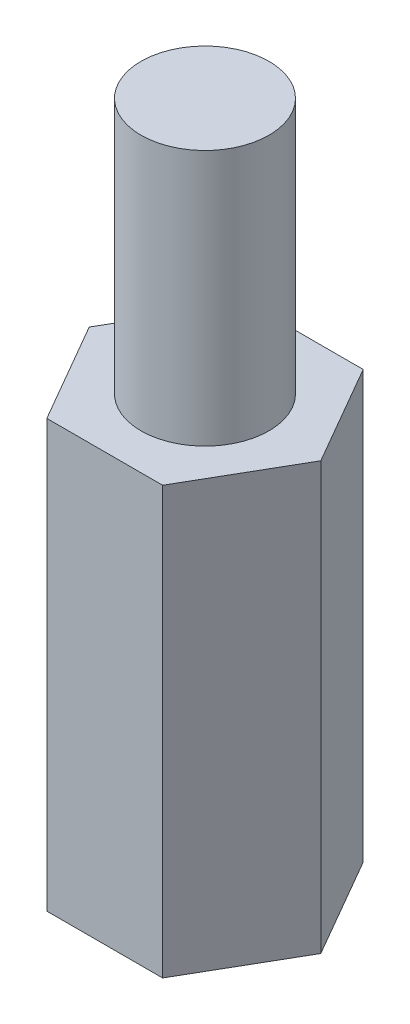
ISO-10303-21;
HEADER;
FILE_DESCRIPTION(('STEP AP214'),'2;1');
FILE_NAME('part.step','',(''),(''),'','','');
FILE_SCHEMA(('AUTOMOTIVE_DESIGN { 1 0 10303 214 1 1 1 1 }'));
ENDSEC;
DATA;
#1=APPLICATION_CONTEXT('core data for automotive mechanical design processes');
#2=APPLICATION_PROTOCOL_DEFINITION('international standard','automotive_design',2000,#1);
#3=PRODUCT_CONTEXT('',#1,'mechanical');
#4=PRODUCT('Part','Part','',(#3));
#5=PRODUCT_RELATED_PRODUCT_CATEGORY('part','',(#4));
#6=PRODUCT_DEFINITION_FORMATION('','',#4);
#7=PRODUCT_DEFINITION_CONTEXT('part definition',#1,'design');
#8=PRODUCT_DEFINITION('design','',#6,#7);
#9=PRODUCT_DEFINITION_SHAPE('','',#8);
#10=(LENGTH_UNIT() NAMED_UNIT(*) SI_UNIT(.MILLI.,.METRE.));
#11=(NAMED_UNIT(*) PLANE_ANGLE_UNIT() SI_UNIT($,.RADIAN.));
#12=(NAMED_UNIT(*) SI_UNIT($,.STERADIAN.) SOLID_ANGLE_UNIT());
#13=UNCERTAINTY_MEASURE_WITH_UNIT(LENGTH_MEASURE(1.E-05),#10,'distance_accuracy_value','');
#14=(GEOMETRIC_REPRESENTATION_CONTEXT(3) GLOBAL_UNCERTAINTY_ASSIGNED_CONTEXT((#13)) GLOBAL_UNIT_ASSIGNED_CONTEXT((#10,
#11,#12)) REPRESENTATION_CONTEXT('',''));
#15=CARTESIAN_POINT('',(0.,0.,0.));
#16=DIRECTION('',(0.,0.,1.));
#17=DIRECTION('',(1.,0.,0.));
#18=AXIS2_PLACEMENT_3D('',#15,#16,#17);
#19=CARTESIAN_POINT('',(2.71354626519124,10.,0.));
#20=DIRECTION('',(-0.866025403784438,0.,0.5));
#21=DIRECTION('',(0.5,0.,0.866025403784439));
#22=AXIS2_PLACEMENT_3D('',#19,#20,#21);
#23=PLANE('',#22);
#24=DIRECTION('',(-0.5,0.,-0.866025403784438));
#25=VECTOR('',#24,1.);
#26=CARTESIAN_POINT('',(2.71354626519124,0.,0.));
#27=LINE('',#26,#25);
#28=CARTESIAN_POINT('',(2.71354626519124,0.,0.));
#29=VERTEX_POINT('',#28);
#30=CARTESIAN_POINT('',(1.35677313259562,0.,-2.35));
#31=VERTEX_POINT('',#30);
#32=EDGE_CURVE('E120',#29,#31,#27,.T.);
#33=ORIENTED_EDGE('',*,*,#32,.T.);
#34=DIRECTION('',(0.,-1.,0.));
#35=VECTOR('',#34,1.);
#36=CARTESIAN_POINT('',(1.35677313259562,10.,-2.35));
#37=LINE('',#36,#35);
#38=CARTESIAN_POINT('',(1.35677313259562,10.,-2.35));
#39=VERTEX_POINT('',#38);
#40=EDGE_CURVE('E37',#39,#31,#37,.T.);
#41=ORIENTED_EDGE('',*,*,#40,.F.);
#42=DIRECTION('',(-0.5,0.,-0.866025403784438));
#43=VECTOR('',#42,1.);
#44=CARTESIAN_POINT('',(2.71354626519124,10.,0.));
#45=LINE('',#44,#43);
#46=CARTESIAN_POINT('',(2.71354626519124,10.,0.));
#47=VERTEX_POINT('',#46);
#48=EDGE_CURVE('E131',#47,#39,#45,.T.);
#49=ORIENTED_EDGE('',*,*,#48,.F.);
#50=DIRECTION('',(0.,-1.,0.));
#51=VECTOR('',#50,1.);
#52=CARTESIAN_POINT('',(2.71354626519124,10.,0.));
#53=LINE('',#52,#51);
#54=EDGE_CURVE('E116',#47,#29,#53,.T.);
#55=ORIENTED_EDGE('',*,*,#54,.T.);
#56=EDGE_LOOP('',(#33,#41,#49,#55));
#57=FACE_BOUND('',#56,.T.);
#58=ADVANCED_FACE('F34',(#57),#23,.F.);
#59=CARTESIAN_POINT('',(1.35677313259562,10.,-2.35));
#60=DIRECTION('',(0.,0.,1.));
#61=DIRECTION('',(1.,0.,0.));
#62=AXIS2_PLACEMENT_3D('',#59,#60,#61);
#63=PLANE('',#62);
#64=DIRECTION('',(-1.,0.,0.));
#65=VECTOR('',#64,1.);
#66=CARTESIAN_POINT('',(1.35677313259562,0.,-2.35));
#67=LINE('',#66,#65);
#68=CARTESIAN_POINT('',(-1.35677313259562,0.,-2.35));
#69=VERTEX_POINT('',#68);
#70=EDGE_CURVE('E123',#31,#69,#67,.T.);
#71=ORIENTED_EDGE('',*,*,#70,.T.);
#72=DIRECTION('',(0.,-1.,0.));
#73=VECTOR('',#72,1.);
#74=CARTESIAN_POINT('',(-1.35677313259562,10.,-2.35));
#75=LINE('',#74,#73);
#76=CARTESIAN_POINT('',(-1.35677313259562,10.,-2.35));
#77=VERTEX_POINT('',#76);
#78=EDGE_CURVE('E134',#77,#69,#75,.T.);
#79=ORIENTED_EDGE('',*,*,#78,.F.);
#80=DIRECTION('',(-1.,0.,0.));
#81=VECTOR('',#80,1.);
#82=CARTESIAN_POINT('',(1.35677313259562,10.,-2.35));
#83=LINE('',#82,#81);
#84=EDGE_CURVE('E89',#39,#77,#83,.T.);
#85=ORIENTED_EDGE('',*,*,#84,.F.);
#86=ORIENTED_EDGE('',*,*,#40,.T.);
#87=EDGE_LOOP('',(#71,#79,#85,#86));
#88=FACE_BOUND('',#87,.T.);
#89=ADVANCED_FACE('F139',(#88),#63,.F.);
#90=CARTESIAN_POINT('',(-1.35677313259562,10.,-2.35));
#91=DIRECTION('',(0.866025403784439,0.,0.5));
#92=DIRECTION('',(0.5,0.,-0.866025403784439));
#93=AXIS2_PLACEMENT_3D('',#90,#91,#92);
#94=PLANE('',#93);
#95=DIRECTION('',(-0.5,0.,0.866025403784439));
#96=VECTOR('',#95,1.);
#97=CARTESIAN_POINT('',(-1.35677313259562,0.,-2.35));
#98=LINE('',#97,#96);
#99=CARTESIAN_POINT('',(-2.71354626519124,0.,0.));
#100=VERTEX_POINT('',#99);
#101=EDGE_CURVE('E126',#69,#100,#98,.T.);
#102=ORIENTED_EDGE('',*,*,#101,.T.);
#103=DIRECTION('',(0.,-1.,0.));
#104=VECTOR('',#103,1.);
#105=CARTESIAN_POINT('',(-2.71354626519124,10.,0.));
#106=LINE('',#105,#104);
#107=CARTESIAN_POINT('',(-2.71354626519124,10.,0.));
#108=VERTEX_POINT('',#107);
#109=EDGE_CURVE('E111',#108,#100,#106,.T.);
#110=ORIENTED_EDGE('',*,*,#109,.F.);
#111=DIRECTION('',(-0.5,0.,0.866025403784439));
#112=VECTOR('',#111,1.);
#113=CARTESIAN_POINT('',(-1.35677313259562,10.,-2.35));
#114=LINE('',#113,#112);
#115=EDGE_CURVE('E102',#77,#108,#114,.T.);
#116=ORIENTED_EDGE('',*,*,#115,.F.);
#117=ORIENTED_EDGE('',*,*,#78,.T.);
#118=EDGE_LOOP('',(#102,#110,#116,#117));
#119=FACE_BOUND('',#118,.T.);
#120=ADVANCED_FACE('F145',(#119),#94,.F.);
#121=CARTESIAN_POINT('',(-2.71354626519124,10.,0.));
#122=DIRECTION('',(0.866025403784438,0.,-0.5));
#123=DIRECTION('',(-0.5,0.,-0.866025403784438));
#124=AXIS2_PLACEMENT_3D('',#121,#122,#123);
#125=PLANE('',#124);
#126=DIRECTION('',(0.5,0.,0.866025403784438));
#127=VECTOR('',#126,1.);
#128=CARTESIAN_POINT('',(-2.71354626519124,0.,0.));
#129=LINE('',#128,#127);
#130=CARTESIAN_POINT('',(-1.35677313259562,0.,2.35));
#131=VERTEX_POINT('',#130);
#132=EDGE_CURVE('E110',#100,#131,#129,.T.);
#133=ORIENTED_EDGE('',*,*,#132,.T.);
#134=DIRECTION('',(0.,-1.,0.));
#135=VECTOR('',#134,1.);
#136=CARTESIAN_POINT('',(-1.35677313259562,10.,2.35));
#137=LINE('',#136,#135);
#138=CARTESIAN_POINT('',(-1.35677313259562,10.,2.35));
#139=VERTEX_POINT('',#138);
#140=EDGE_CURVE('E107',#139,#131,#137,.T.);
#141=ORIENTED_EDGE('',*,*,#140,.F.);
#142=DIRECTION('',(0.5,0.,0.866025403784438));
#143=VECTOR('',#142,1.);
#144=CARTESIAN_POINT('',(-2.71354626519124,10.,0.));
#145=LINE('',#144,#143);
#146=EDGE_CURVE('E96',#108,#139,#145,.T.);
#147=ORIENTED_EDGE('',*,*,#146,.F.);
#148=ORIENTED_EDGE('',*,*,#109,.T.);
#149=EDGE_LOOP('',(#133,#141,#147,#148));
#150=FACE_BOUND('',#149,.T.);
#151=ADVANCED_FACE('F108',(#150),#125,.F.);
#152=CARTESIAN_POINT('',(-1.35677313259562,10.,2.35));
#153=DIRECTION('',(0.,0.,-1.));
#154=DIRECTION('',(-1.,0.,0.));
#155=AXIS2_PLACEMENT_3D('',#152,#153,#154);
#156=PLANE('',#155);
#157=DIRECTION('',(1.,0.,0.));
#158=VECTOR('',#157,1.);
#159=CARTESIAN_POINT('',(-1.35677313259562,0.,2.35));
#160=LINE('',#159,#158);
#161=CARTESIAN_POINT('',(1.35677313259562,0.,2.35));
#162=VERTEX_POINT('',#161);
#163=EDGE_CURVE('E74',#131,#162,#160,.T.);
#164=ORIENTED_EDGE('',*,*,#163,.T.);
#165=DIRECTION('',(0.,-1.,0.));
#166=VECTOR('',#165,1.);
#167=CARTESIAN_POINT('',(1.35677313259562,10.,2.35));
#168=LINE('',#167,#166);
#169=CARTESIAN_POINT('',(1.35677313259562,10.,2.35));
#170=VERTEX_POINT('',#169);
#171=EDGE_CURVE('E112',#170,#162,#168,.T.);
#172=ORIENTED_EDGE('',*,*,#171,.F.);
#173=DIRECTION('',(1.,0.,0.));
#174=VECTOR('',#173,1.);
#175=CARTESIAN_POINT('',(-1.35677313259562,10.,2.35));
#176=LINE('',#175,#174);
#177=EDGE_CURVE('E100',#139,#170,#176,.T.);
#178=ORIENTED_EDGE('',*,*,#177,.F.);
#179=ORIENTED_EDGE('',*,*,#140,.T.);
#180=EDGE_LOOP('',(#164,#172,#178,#179));
#181=FACE_BOUND('',#180,.T.);
#182=ADVANCED_FACE('F114',(#181),#156,.F.);
#183=CARTESIAN_POINT('',(1.35677313259562,10.,2.35));
#184=DIRECTION('',(-0.866025403784439,0.,-0.5));
#185=DIRECTION('',(-0.5,0.,0.866025403784439));
#186=AXIS2_PLACEMENT_3D('',#183,#184,#185);
#187=PLANE('',#186);
#188=DIRECTION('',(0.5,0.,-0.866025403784439));
#189=VECTOR('',#188,1.);
#190=CARTESIAN_POINT('',(1.35677313259562,0.,2.35));
#191=LINE('',#190,#189);
#192=EDGE_CURVE('E80',#162,#29,#191,.T.);
#193=ORIENTED_EDGE('',*,*,#192,.T.);
#194=ORIENTED_EDGE('',*,*,#54,.F.);
#195=DIRECTION('',(0.5,0.,-0.866025403784439));
#196=VECTOR('',#195,1.);
#197=CARTESIAN_POINT('',(1.35677313259562,10.,2.35));
#198=LINE('',#197,#196);
#199=EDGE_CURVE('E51',#170,#47,#198,.T.);
#200=ORIENTED_EDGE('',*,*,#199,.F.);
#201=ORIENTED_EDGE('',*,*,#171,.T.);
#202=EDGE_LOOP('',(#193,#194,#200,#201));
#203=FACE_BOUND('',#202,.T.);
#204=ADVANCED_FACE('F176',(#203),#187,.F.);
#205=CARTESIAN_POINT('',(0.,10.,0.));
#206=DIRECTION('',(0.,1.,0.));
#207=DIRECTION('',(0.,0.,1.));
#208=AXIS2_PLACEMENT_3D('',#205,#206,#207);
#209=PLANE('',#208);
#210=CARTESIAN_POINT('',(0.,10.,0.));
#211=DIRECTION('',(0.,1.,0.));
#212=DIRECTION('',(0.,0.,1.));
#213=AXIS2_PLACEMENT_3D('',#210,#211,#212);
#214=CIRCLE('',#213,1.5);
#215=CARTESIAN_POINT('',(0.,10.,1.5));
#216=VERTEX_POINT('',#215);
#217=EDGE_CURVE('E11',#216,#216,#214,.T.);
#218=ORIENTED_EDGE('',*,*,#217,.F.);
#219=EDGE_LOOP('',(#218));
#220=FACE_BOUND('',#219,.T.);
#221=ORIENTED_EDGE('',*,*,#48,.T.);
#222=ORIENTED_EDGE('',*,*,#84,.T.);
#223=ORIENTED_EDGE('',*,*,#115,.T.);
#224=ORIENTED_EDGE('',*,*,#146,.T.);
#225=ORIENTED_EDGE('',*,*,#177,.T.);
#226=ORIENTED_EDGE('',*,*,#199,.T.);
#227=EDGE_LOOP('',(#221,#222,#223,#224,#225,#226));
#228=FACE_BOUND('',#227,.T.);
#229=ADVANCED_FACE('F98',(#220,#228),#209,.T.);
#230=CARTESIAN_POINT('',(0.,0.,0.));
#231=DIRECTION('',(0.,1.,0.));
#232=DIRECTION('',(0.,0.,1.));
#233=AXIS2_PLACEMENT_3D('',#230,#231,#232);
#234=PLANE('',#233);
#235=CARTESIAN_POINT('',(0.,0.,0.));
#236=DIRECTION('',(0.,-1.,0.));
#237=DIRECTION('',(0.,0.,-1.));
#238=AXIS2_PLACEMENT_3D('',#235,#236,#237);
#239=CIRCLE('',#238,1.5);
#240=CARTESIAN_POINT('',(0.,0.,-1.5));
#241=VERTEX_POINT('',#240);
#242=EDGE_CURVE('E152',#241,#241,#239,.T.);
#243=ORIENTED_EDGE('',*,*,#242,.F.);
#244=EDGE_LOOP('',(#243));
#245=FACE_BOUND('',#244,.T.);
#246=ORIENTED_EDGE('',*,*,#32,.F.);
#247=ORIENTED_EDGE('',*,*,#192,.F.);
#248=ORIENTED_EDGE('',*,*,#163,.F.);
#249=ORIENTED_EDGE('',*,*,#132,.F.);
#250=ORIENTED_EDGE('',*,*,#101,.F.);
#251=ORIENTED_EDGE('',*,*,#70,.F.);
#252=EDGE_LOOP('',(#246,#247,#248,#249,#250,#251));
#253=FACE_BOUND('',#252,.T.);
#254=ADVANCED_FACE('F144',(#245,#253),#234,.F.);
#255=CARTESIAN_POINT('',(0.,16.,0.));
#256=DIRECTION('',(0.,-1.,0.));
#257=DIRECTION('',(0.,0.,-1.));
#258=AXIS2_PLACEMENT_3D('',#255,#256,#257);
#259=CYLINDRICAL_SURFACE('',#258,1.5);
#260=CARTESIAN_POINT('',(0.,16.,0.));
#261=DIRECTION('',(0.,1.,0.));
#262=DIRECTION('',(0.,0.,1.));
#263=AXIS2_PLACEMENT_3D('',#260,#261,#262);
#264=CIRCLE('',#263,1.5);
#265=CARTESIAN_POINT('',(0.,16.,1.5));
#266=VERTEX_POINT('',#265);
#267=EDGE_CURVE('E124',#266,#266,#264,.T.);
#268=ORIENTED_EDGE('',*,*,#267,.F.);
#269=EDGE_LOOP('',(#268));
#270=FACE_BOUND('',#269,.T.);
#271=ORIENTED_EDGE('',*,*,#217,.T.);
#272=EDGE_LOOP('',(#271));
#273=FACE_BOUND('',#272,.T.);
#274=ADVANCED_FACE('F168',(#270,#273),#259,.T.);
#275=CARTESIAN_POINT('',(0.,16.,0.));
#276=DIRECTION('',(0.,1.,0.));
#277=DIRECTION('',(0.,0.,1.));
#278=AXIS2_PLACEMENT_3D('',#275,#276,#277);
#279=PLANE('',#278);
#280=ORIENTED_EDGE('',*,*,#267,.T.);
#281=EDGE_LOOP('',(#280));
#282=FACE_BOUND('',#281,.T.);
#283=ADVANCED_FACE('F163',(#282),#279,.T.);
#284=CARTESIAN_POINT('',(0.,7.,0.));
#285=DIRECTION('',(0.,-1.,0.));
#286=DIRECTION('',(0.,0.,-1.));
#287=AXIS2_PLACEMENT_3D('',#284,#285,#286);
#288=CYLINDRICAL_SURFACE('',#287,1.5);
#289=CARTESIAN_POINT('',(0.,7.,0.));
#290=DIRECTION('',(0.,-1.,0.));
#291=DIRECTION('',(0.,0.,-1.));
#292=AXIS2_PLACEMENT_3D('',#289,#290,#291);
#293=CIRCLE('',#292,1.5);
#294=CARTESIAN_POINT('',(0.,7.,-1.5));
#295=VERTEX_POINT('',#294);
#296=EDGE_CURVE('E151',#295,#295,#293,.T.);
#297=ORIENTED_EDGE('',*,*,#296,.F.);
#298=EDGE_LOOP('',(#297));
#299=FACE_BOUND('',#298,.T.);
#300=ORIENTED_EDGE('',*,*,#242,.T.);
#301=EDGE_LOOP('',(#300));
#302=FACE_BOUND('',#301,.T.);
#303=ADVANCED_FACE('F160',(#299,#302),#288,.F.);
#304=CARTESIAN_POINT('',(0.,7.,0.));
#305=DIRECTION('',(0.,-1.,0.));
#306=DIRECTION('',(0.,0.,-1.));
#307=AXIS2_PLACEMENT_3D('',#304,#305,#306);
#308=PLANE('',#307);
#309=ORIENTED_EDGE('',*,*,#296,.T.);
#310=EDGE_LOOP('',(#309));
#311=FACE_BOUND('',#310,.T.);
#312=ADVANCED_FACE('F158',(#311),#308,.T.);
#313=CLOSED_SHELL('',(#58,#89,#120,#151,#182,#204,#229,#254,#274,#283,#303,#312));
#314=MANIFOLD_SOLID_BREP('B2',#313);
#315=ADVANCED_BREP_SHAPE_REPRESENTATION('',(#18,#314),#14);
#316=SHAPE_DEFINITION_REPRESENTATION(#9,#315);
ENDSEC;
END-ISO-10303-21;
